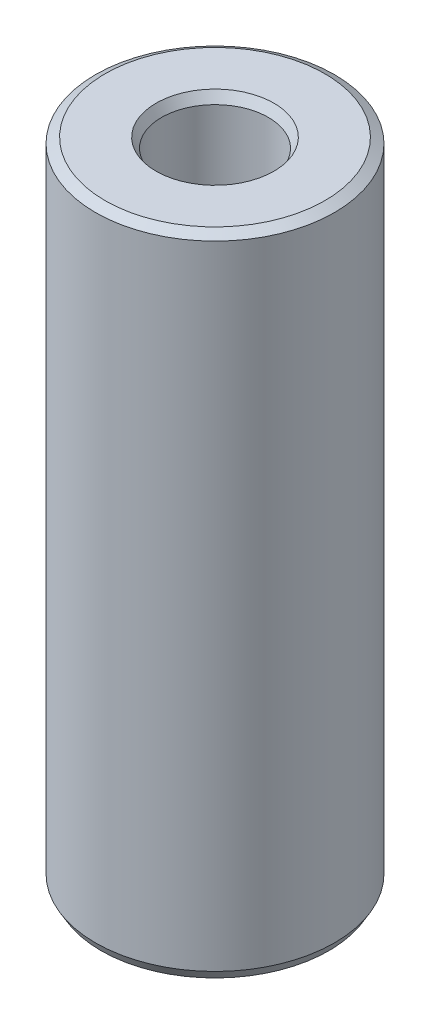
ISO-10303-21;
HEADER;
FILE_DESCRIPTION(('STEP AP214'),'2;1');
FILE_NAME('part.step','',(''),(''),'','','');
FILE_SCHEMA(('AUTOMOTIVE_DESIGN { 1 0 10303 214 1 1 1 1 }'));
ENDSEC;
DATA;
#1=APPLICATION_CONTEXT('core data for automotive mechanical design processes');
#2=APPLICATION_PROTOCOL_DEFINITION('international standard','automotive_design',2000,#1);
#3=PRODUCT_CONTEXT('',#1,'mechanical');
#4=PRODUCT('Part','Part','',(#3));
#5=PRODUCT_RELATED_PRODUCT_CATEGORY('part','',(#4));
#6=PRODUCT_DEFINITION_FORMATION('','',#4);
#7=PRODUCT_DEFINITION_CONTEXT('part definition',#1,'design');
#8=PRODUCT_DEFINITION('design','',#6,#7);
#9=PRODUCT_DEFINITION_SHAPE('','',#8);
#10=(LENGTH_UNIT() NAMED_UNIT(*) SI_UNIT(.MILLI.,.METRE.));
#11=(NAMED_UNIT(*) PLANE_ANGLE_UNIT() SI_UNIT($,.RADIAN.));
#12=(NAMED_UNIT(*) SI_UNIT($,.STERADIAN.) SOLID_ANGLE_UNIT());
#13=UNCERTAINTY_MEASURE_WITH_UNIT(LENGTH_MEASURE(1.E-05),#10,'distance_accuracy_value','');
#14=(GEOMETRIC_REPRESENTATION_CONTEXT(3) GLOBAL_UNCERTAINTY_ASSIGNED_CONTEXT((#13)) GLOBAL_UNIT_ASSIGNED_CONTEXT((#10,
#11,#12)) REPRESENTATION_CONTEXT('',''));
#15=CARTESIAN_POINT('',(0.,0.,0.));
#16=DIRECTION('',(0.,0.,1.));
#17=DIRECTION('',(1.,0.,0.));
#18=AXIS2_PLACEMENT_3D('',#15,#16,#17);
#19=CARTESIAN_POINT('',(0.,40.6446699069298,0.));
#20=DIRECTION('',(0.,-1.,0.));
#21=DIRECTION('',(0.,0.,-1.));
#22=AXIS2_PLACEMENT_3D('',#19,#20,#21);
#23=CYLINDRICAL_SURFACE('',#22,7.5);
#24=CARTESIAN_POINT('',(0.,0.600482692874951,0.));
#25=DIRECTION('',(0.,1.,0.));
#26=DIRECTION('',(0.,0.,1.));
#27=AXIS2_PLACEMENT_3D('',#24,#25,#26);
#28=CIRCLE('',#27,7.5);
#29=CARTESIAN_POINT('',(0.,0.600482692874951,7.5));
#30=VERTEX_POINT('',#29);
#31=EDGE_CURVE('E10',#30,#30,#28,.T.);
#32=ORIENTED_EDGE('',*,*,#31,.T.);
#33=EDGE_LOOP('',(#32));
#34=FACE_BOUND('',#33,.T.);
#35=CARTESIAN_POINT('',(0.,40.2979810625548,0.));
#36=DIRECTION('',(0.,1.,0.));
#37=DIRECTION('',(0.,0.,1.));
#38=AXIS2_PLACEMENT_3D('',#35,#36,#37);
#39=CIRCLE('',#38,7.5);
#40=CARTESIAN_POINT('',(0.,40.2979810625548,7.5));
#41=VERTEX_POINT('',#40);
#42=EDGE_CURVE('E50',#41,#41,#39,.F.);
#43=ORIENTED_EDGE('',*,*,#42,.T.);
#44=EDGE_LOOP('',(#43));
#45=FACE_BOUND('',#44,.T.);
#46=ADVANCED_FACE('F39',(#34,#45),#23,.T.);
#47=CARTESIAN_POINT('',(0.,40.6446699069298,0.));
#48=DIRECTION('',(0.,1.,0.));
#49=DIRECTION('',(0.,0.,1.));
#50=AXIS2_PLACEMENT_3D('',#47,#48,#49);
#51=PLANE('',#50);
#52=CARTESIAN_POINT('',(0.,40.6446699069298,0.));
#53=DIRECTION('',(0.,1.,0.));
#54=DIRECTION('',(0.,0.,1.));
#55=AXIS2_PLACEMENT_3D('',#52,#53,#54);
#56=CIRCLE('',#55,3.70073151923603);
#57=CARTESIAN_POINT('',(0.,40.6446699069298,3.70073151923603));
#58=VERTEX_POINT('',#57);
#59=EDGE_CURVE('E58',#58,#58,#56,.F.);
#60=ORIENTED_EDGE('',*,*,#59,.T.);
#61=EDGE_LOOP('',(#60));
#62=FACE_BOUND('',#61,.T.);
#63=CARTESIAN_POINT('',(0.,40.6446699069298,0.));
#64=DIRECTION('',(0.,1.,0.));
#65=DIRECTION('',(0.,0.,1.));
#66=AXIS2_PLACEMENT_3D('',#63,#64,#65);
#67=CIRCLE('',#66,6.89951730712504);
#68=CARTESIAN_POINT('',(0.,40.6446699069298,6.89951730712504));
#69=VERTEX_POINT('',#68);
#70=EDGE_CURVE('E61',#69,#69,#67,.T.);
#71=ORIENTED_EDGE('',*,*,#70,.T.);
#72=EDGE_LOOP('',(#71));
#73=FACE_BOUND('',#72,.T.);
#74=ADVANCED_FACE('F88',(#62,#73),#51,.T.);
#75=CARTESIAN_POINT('',(0.,0.,0.));
#76=DIRECTION('',(0.,1.,0.));
#77=DIRECTION('',(0.,0.,1.));
#78=AXIS2_PLACEMENT_3D('',#75,#76,#77);
#79=PLANE('',#78);
#80=CARTESIAN_POINT('',(0.,0.,0.));
#81=DIRECTION('',(0.,1.,0.));
#82=DIRECTION('',(0.,0.,1.));
#83=AXIS2_PLACEMENT_3D('',#80,#81,#82);
#84=CIRCLE('',#83,3.95452536773593);
#85=CARTESIAN_POINT('',(0.,0.,3.95452536773593));
#86=VERTEX_POINT('',#85);
#87=EDGE_CURVE('E51',#86,#86,#84,.T.);
#88=ORIENTED_EDGE('',*,*,#87,.T.);
#89=EDGE_LOOP('',(#88));
#90=FACE_BOUND('',#89,.T.);
#91=CARTESIAN_POINT('',(0.,0.,0.));
#92=DIRECTION('',(0.,1.,0.));
#93=DIRECTION('',(0.,0.,1.));
#94=AXIS2_PLACEMENT_3D('',#91,#92,#93);
#95=CIRCLE('',#94,7.15331115562493);
#96=CARTESIAN_POINT('',(0.,0.,7.15331115562493));
#97=VERTEX_POINT('',#96);
#98=EDGE_CURVE('E54',#97,#97,#95,.F.);
#99=ORIENTED_EDGE('',*,*,#98,.T.);
#100=EDGE_LOOP('',(#99));
#101=FACE_BOUND('',#100,.T.);
#102=ADVANCED_FACE('F83',(#90,#101),#79,.F.);
#103=CARTESIAN_POINT('',(0.,40.6446699069298,0.));
#104=DIRECTION('',(0.,-1.,0.));
#105=DIRECTION('',(0.,0.,-1.));
#106=AXIS2_PLACEMENT_3D('',#103,#104,#105);
#107=CYLINDRICAL_SURFACE('',#106,3.35404267486097);
#108=CARTESIAN_POINT('',(0.,40.0441872140549,0.));
#109=DIRECTION('',(0.,1.,0.));
#110=DIRECTION('',(0.,0.,1.));
#111=AXIS2_PLACEMENT_3D('',#108,#109,#110);
#112=CIRCLE('',#111,3.35404267486097);
#113=CARTESIAN_POINT('',(0.,40.0441872140549,3.35404267486097));
#114=VERTEX_POINT('',#113);
#115=EDGE_CURVE('E67',#114,#114,#112,.T.);
#116=ORIENTED_EDGE('',*,*,#115,.T.);
#117=EDGE_LOOP('',(#116));
#118=FACE_BOUND('',#117,.T.);
#119=CARTESIAN_POINT('',(0.,0.346688844375075,0.));
#120=DIRECTION('',(0.,1.,0.));
#121=DIRECTION('',(0.,0.,1.));
#122=AXIS2_PLACEMENT_3D('',#119,#120,#121);
#123=CIRCLE('',#122,3.35404267486097);
#124=CARTESIAN_POINT('',(0.,0.346688844375075,3.35404267486097));
#125=VERTEX_POINT('',#124);
#126=EDGE_CURVE('E69',#125,#125,#123,.F.);
#127=ORIENTED_EDGE('',*,*,#126,.T.);
#128=EDGE_LOOP('',(#127));
#129=FACE_BOUND('',#128,.T.);
#130=ADVANCED_FACE('F71',(#118,#129),#107,.F.);
#131=CARTESIAN_POINT('',(0.,40.0441872140549,0.));
#132=DIRECTION('',(0.,1.,0.));
#133=DIRECTION('',(0.,0.,1.));
#134=AXIS2_PLACEMENT_3D('',#131,#132,#133);
#135=CONICAL_SURFACE('',#134,3.35404267486097,0.523598775598299);
#136=ORIENTED_EDGE('',*,*,#59,.F.);
#137=EDGE_LOOP('',(#136));
#138=FACE_BOUND('',#137,.T.);
#139=ORIENTED_EDGE('',*,*,#115,.F.);
#140=EDGE_LOOP('',(#139));
#141=FACE_BOUND('',#140,.T.);
#142=ADVANCED_FACE('F77',(#138,#141),#135,.F.);
#143=CARTESIAN_POINT('',(0.,0.,0.));
#144=DIRECTION('',(0.,-1.,0.));
#145=DIRECTION('',(0.,0.,-1.));
#146=AXIS2_PLACEMENT_3D('',#143,#144,#145);
#147=CONICAL_SURFACE('',#146,3.95452536773593,1.04719755119659);
#148=ORIENTED_EDGE('',*,*,#126,.F.);
#149=EDGE_LOOP('',(#148));
#150=FACE_BOUND('',#149,.T.);
#151=ORIENTED_EDGE('',*,*,#87,.F.);
#152=EDGE_LOOP('',(#151));
#153=FACE_BOUND('',#152,.T.);
#154=ADVANCED_FACE('F73',(#150,#153),#147,.F.);
#155=CARTESIAN_POINT('',(0.,0.600482692874951,0.));
#156=DIRECTION('',(0.,1.,0.));
#157=DIRECTION('',(0.,0.,1.));
#158=AXIS2_PLACEMENT_3D('',#155,#156,#157);
#159=CONICAL_SURFACE('',#158,7.5,0.523598775598303);
#160=ORIENTED_EDGE('',*,*,#98,.F.);
#161=EDGE_LOOP('',(#160));
#162=FACE_BOUND('',#161,.T.);
#163=ORIENTED_EDGE('',*,*,#31,.F.);
#164=EDGE_LOOP('',(#163));
#165=FACE_BOUND('',#164,.T.);
#166=ADVANCED_FACE('F76',(#162,#165),#159,.T.);
#167=CARTESIAN_POINT('',(0.,40.6446699069298,0.));
#168=DIRECTION('',(0.,-1.,0.));
#169=DIRECTION('',(0.,0.,-1.));
#170=AXIS2_PLACEMENT_3D('',#167,#168,#169);
#171=CONICAL_SURFACE('',#170,6.89951730712504,1.04719755119659);
#172=ORIENTED_EDGE('',*,*,#42,.F.);
#173=EDGE_LOOP('',(#172));
#174=FACE_BOUND('',#173,.T.);
#175=ORIENTED_EDGE('',*,*,#70,.F.);
#176=EDGE_LOOP('',(#175));
#177=FACE_BOUND('',#176,.T.);
#178=ADVANCED_FACE('F45',(#174,#177),#171,.T.);
#179=CLOSED_SHELL('',(#46,#74,#102,#130,#142,#154,#166,#178));
#180=MANIFOLD_SOLID_BREP('B2',#179);
#181=ADVANCED_BREP_SHAPE_REPRESENTATION('',(#18,#180),#14);
#182=SHAPE_DEFINITION_REPRESENTATION(#9,#181);
ENDSEC;
END-ISO-10303-21;
